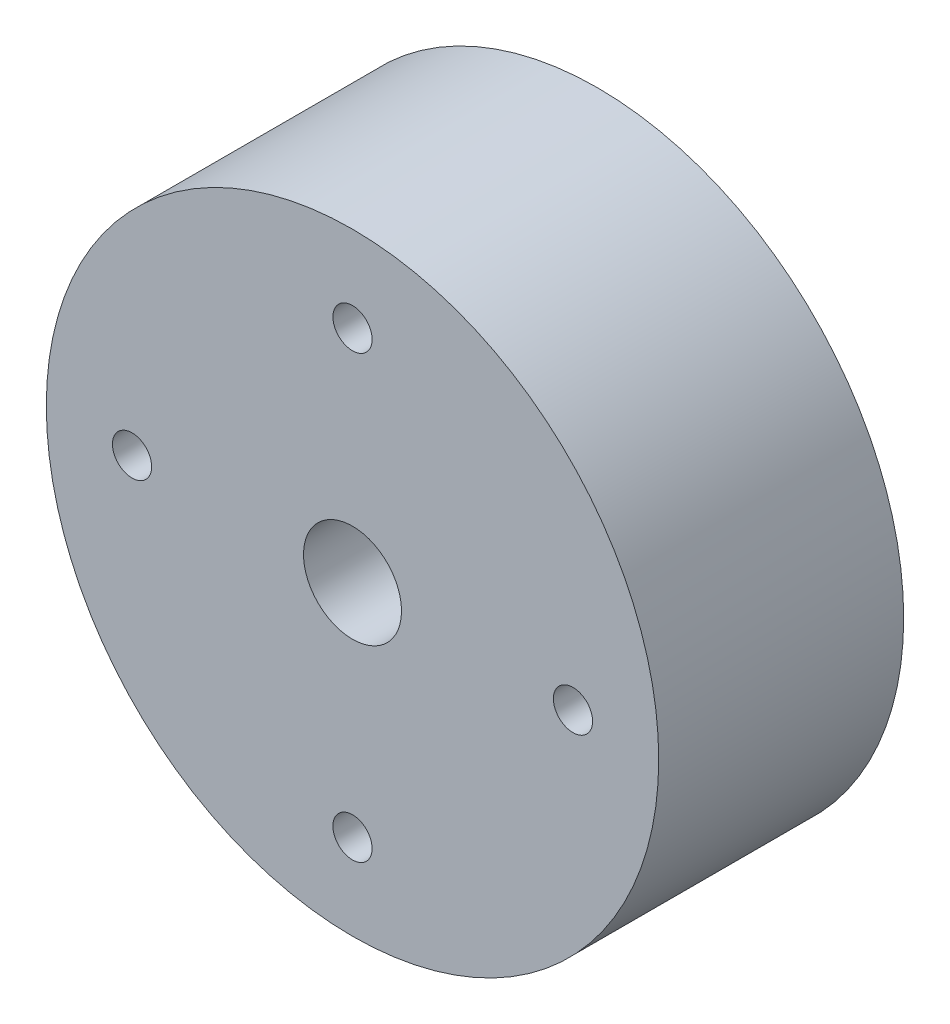
ISO-10303-21;
HEADER;
FILE_DESCRIPTION(('STEP AP214'),'2;1');
FILE_NAME('part.step','',(''),(''),'','','');
FILE_SCHEMA(('AUTOMOTIVE_DESIGN { 1 0 10303 214 1 1 1 1 }'));
ENDSEC;
DATA;
#1=APPLICATION_CONTEXT('core data for automotive mechanical design processes');
#2=APPLICATION_PROTOCOL_DEFINITION('international standard','automotive_design',2000,#1);
#3=PRODUCT_CONTEXT('',#1,'mechanical');
#4=PRODUCT('Part','Part','',(#3));
#5=PRODUCT_RELATED_PRODUCT_CATEGORY('part','',(#4));
#6=PRODUCT_DEFINITION_FORMATION('','',#4);
#7=PRODUCT_DEFINITION_CONTEXT('part definition',#1,'design');
#8=PRODUCT_DEFINITION('design','',#6,#7);
#9=PRODUCT_DEFINITION_SHAPE('','',#8);
#10=(LENGTH_UNIT() NAMED_UNIT(*) SI_UNIT(.MILLI.,.METRE.));
#11=(NAMED_UNIT(*) PLANE_ANGLE_UNIT() SI_UNIT($,.RADIAN.));
#12=(NAMED_UNIT(*) SI_UNIT($,.STERADIAN.) SOLID_ANGLE_UNIT());
#13=UNCERTAINTY_MEASURE_WITH_UNIT(LENGTH_MEASURE(1.E-05),#10,'distance_accuracy_value','');
#14=(GEOMETRIC_REPRESENTATION_CONTEXT(3) GLOBAL_UNCERTAINTY_ASSIGNED_CONTEXT((#13)) GLOBAL_UNIT_ASSIGNED_CONTEXT((#10,
#11,#12)) REPRESENTATION_CONTEXT('',''));
#15=CARTESIAN_POINT('',(0.,0.,0.));
#16=DIRECTION('',(0.,0.,1.));
#17=DIRECTION('',(1.,0.,0.));
#18=AXIS2_PLACEMENT_3D('',#15,#16,#17);
#19=CARTESIAN_POINT('',(0.,0.,20.));
#20=DIRECTION('',(0.,0.,1.));
#21=DIRECTION('',(1.,0.,0.));
#22=AXIS2_PLACEMENT_3D('',#19,#20,#21);
#23=PLANE('',#22);
#24=CARTESIAN_POINT('',(0.,18.,20.));
#25=DIRECTION('',(0.,0.,1.));
#26=DIRECTION('',(1.,0.,0.));
#27=AXIS2_PLACEMENT_3D('',#24,#25,#26);
#28=CIRCLE('',#27,1.6);
#29=CARTESIAN_POINT('',(1.6,18.,20.));
#30=VERTEX_POINT('',#29);
#31=EDGE_CURVE('E80',#30,#30,#28,.T.);
#32=ORIENTED_EDGE('',*,*,#31,.F.);
#33=EDGE_LOOP('',(#32));
#34=FACE_BOUND('',#33,.T.);
#35=CARTESIAN_POINT('',(18.0000000000005,5.08284223389574E-13,20.));
#36=DIRECTION('',(0.,0.,1.));
#37=DIRECTION('',(1.,0.,0.));
#38=AXIS2_PLACEMENT_3D('',#35,#36,#37);
#39=CIRCLE('',#38,1.6000000000004);
#40=CARTESIAN_POINT('',(19.6000000000009,5.08284223389574E-13,20.));
#41=VERTEX_POINT('',#40);
#42=EDGE_CURVE('E74',#41,#41,#39,.T.);
#43=ORIENTED_EDGE('',*,*,#42,.F.);
#44=EDGE_LOOP('',(#43));
#45=FACE_BOUND('',#44,.T.);
#46=CARTESIAN_POINT('',(1.01656844677915E-12,-18.,20.));
#47=DIRECTION('',(0.,0.,1.));
#48=DIRECTION('',(1.,0.,0.));
#49=AXIS2_PLACEMENT_3D('',#46,#47,#48);
#50=CIRCLE('',#49,1.60000000000109);
#51=CARTESIAN_POINT('',(1.60000000000211,-18.,20.));
#52=VERTEX_POINT('',#51);
#53=EDGE_CURVE('E68',#52,#52,#50,.T.);
#54=ORIENTED_EDGE('',*,*,#53,.F.);
#55=EDGE_LOOP('',(#54));
#56=FACE_BOUND('',#55,.T.);
#57=CARTESIAN_POINT('',(-17.9999999999995,-5.10488587628039E-13,20.));
#58=DIRECTION('',(0.,0.,1.));
#59=DIRECTION('',(1.,0.,0.));
#60=AXIS2_PLACEMENT_3D('',#57,#58,#59);
#61=CIRCLE('',#60,1.60000000000082);
#62=CARTESIAN_POINT('',(-16.3999999999987,-5.10488587628039E-13,20.));
#63=VERTEX_POINT('',#62);
#64=EDGE_CURVE('E62',#63,#63,#61,.T.);
#65=ORIENTED_EDGE('',*,*,#64,.F.);
#66=EDGE_LOOP('',(#65));
#67=FACE_BOUND('',#66,.T.);
#68=CARTESIAN_POINT('',(0.,0.,20.));
#69=DIRECTION('',(0.,0.,1.));
#70=DIRECTION('',(1.,0.,0.));
#71=AXIS2_PLACEMENT_3D('',#68,#69,#70);
#72=CIRCLE('',#71,25.);
#73=CARTESIAN_POINT('',(25.,0.,20.));
#74=VERTEX_POINT('',#73);
#75=EDGE_CURVE('E11',#74,#74,#72,.T.);
#76=ORIENTED_EDGE('',*,*,#75,.T.);
#77=EDGE_LOOP('',(#76));
#78=FACE_BOUND('',#77,.T.);
#79=CARTESIAN_POINT('',(0.,0.,20.));
#80=DIRECTION('',(0.,0.,1.));
#81=DIRECTION('',(1.,0.,0.));
#82=AXIS2_PLACEMENT_3D('',#79,#80,#81);
#83=CIRCLE('',#82,4.);
#84=CARTESIAN_POINT('',(4.,0.,20.));
#85=VERTEX_POINT('',#84);
#86=EDGE_CURVE('E54',#85,#85,#83,.T.);
#87=ORIENTED_EDGE('',*,*,#86,.F.);
#88=EDGE_LOOP('',(#87));
#89=FACE_BOUND('',#88,.T.);
#90=ADVANCED_FACE('F43',(#34,#45,#56,#67,#78,#89),#23,.T.);
#91=CARTESIAN_POINT('',(0.,0.,0.));
#92=DIRECTION('',(0.,0.,1.));
#93=DIRECTION('',(1.,0.,0.));
#94=AXIS2_PLACEMENT_3D('',#91,#92,#93);
#95=PLANE('',#94);
#96=CARTESIAN_POINT('',(0.,0.,0.));
#97=DIRECTION('',(0.,0.,1.));
#98=DIRECTION('',(1.,0.,0.));
#99=AXIS2_PLACEMENT_3D('',#96,#97,#98);
#100=CIRCLE('',#99,25.);
#101=CARTESIAN_POINT('',(25.,0.,0.));
#102=VERTEX_POINT('',#101);
#103=EDGE_CURVE('E47',#102,#102,#100,.T.);
#104=ORIENTED_EDGE('',*,*,#103,.F.);
#105=EDGE_LOOP('',(#104));
#106=FACE_BOUND('',#105,.T.);
#107=CARTESIAN_POINT('',(0.,0.,0.));
#108=DIRECTION('',(0.,0.,1.));
#109=DIRECTION('',(1.,0.,0.));
#110=AXIS2_PLACEMENT_3D('',#107,#108,#109);
#111=CIRCLE('',#110,4.);
#112=CARTESIAN_POINT('',(4.,0.,0.));
#113=VERTEX_POINT('',#112);
#114=EDGE_CURVE('E56',#113,#113,#111,.T.);
#115=ORIENTED_EDGE('',*,*,#114,.T.);
#116=EDGE_LOOP('',(#115));
#117=FACE_BOUND('',#116,.T.);
#118=ADVANCED_FACE('F97',(#106,#117),#95,.F.);
#119=CARTESIAN_POINT('',(0.,0.,20.));
#120=DIRECTION('',(0.,0.,-1.));
#121=DIRECTION('',(-1.,0.,0.));
#122=AXIS2_PLACEMENT_3D('',#119,#120,#121);
#123=CYLINDRICAL_SURFACE('',#122,25.);
#124=ORIENTED_EDGE('',*,*,#75,.F.);
#125=EDGE_LOOP('',(#124));
#126=FACE_BOUND('',#125,.T.);
#127=ORIENTED_EDGE('',*,*,#103,.T.);
#128=EDGE_LOOP('',(#127));
#129=FACE_BOUND('',#128,.T.);
#130=ADVANCED_FACE('F45',(#126,#129),#123,.T.);
#131=CARTESIAN_POINT('',(0.,0.,20.));
#132=DIRECTION('',(0.,0.,-1.));
#133=DIRECTION('',(-1.,0.,0.));
#134=AXIS2_PLACEMENT_3D('',#131,#132,#133);
#135=CYLINDRICAL_SURFACE('',#134,4.);
#136=ORIENTED_EDGE('',*,*,#86,.T.);
#137=EDGE_LOOP('',(#136));
#138=FACE_BOUND('',#137,.T.);
#139=ORIENTED_EDGE('',*,*,#114,.F.);
#140=EDGE_LOOP('',(#139));
#141=FACE_BOUND('',#140,.T.);
#142=ADVANCED_FACE('F107',(#138,#141),#135,.F.);
#143=CARTESIAN_POINT('',(-17.9999999999995,-5.10488587628039E-13,10.));
#144=DIRECTION('',(0.,0.,1.));
#145=DIRECTION('',(1.,0.,0.));
#146=AXIS2_PLACEMENT_3D('',#143,#144,#145);
#147=CYLINDRICAL_SURFACE('',#146,1.60000000000082);
#148=CARTESIAN_POINT('',(-17.9999999999995,-5.10488587628039E-13,10.));
#149=DIRECTION('',(0.,0.,1.));
#150=DIRECTION('',(1.,0.,0.));
#151=AXIS2_PLACEMENT_3D('',#148,#149,#150);
#152=CIRCLE('',#151,1.60000000000082);
#153=CARTESIAN_POINT('',(-16.3999999999987,-5.10488587628039E-13,10.));
#154=VERTEX_POINT('',#153);
#155=EDGE_CURVE('E65',#154,#154,#152,.T.);
#156=ORIENTED_EDGE('',*,*,#155,.F.);
#157=EDGE_LOOP('',(#156));
#158=FACE_BOUND('',#157,.T.);
#159=ORIENTED_EDGE('',*,*,#64,.T.);
#160=EDGE_LOOP('',(#159));
#161=FACE_BOUND('',#160,.T.);
#162=ADVANCED_FACE('F110',(#158,#161),#147,.F.);
#163=CARTESIAN_POINT('',(-17.9999999999995,-5.10488587628039E-13,10.));
#164=DIRECTION('',(0.,0.,1.));
#165=DIRECTION('',(1.,0.,0.));
#166=AXIS2_PLACEMENT_3D('',#163,#164,#165);
#167=PLANE('',#166);
#168=ORIENTED_EDGE('',*,*,#155,.T.);
#169=EDGE_LOOP('',(#168));
#170=FACE_BOUND('',#169,.T.);
#171=ADVANCED_FACE('F124',(#170),#167,.T.);
#172=CARTESIAN_POINT('',(1.01656844677915E-12,-18.,10.));
#173=DIRECTION('',(0.,0.,1.));
#174=DIRECTION('',(1.,0.,0.));
#175=AXIS2_PLACEMENT_3D('',#172,#173,#174);
#176=CYLINDRICAL_SURFACE('',#175,1.60000000000109);
#177=CARTESIAN_POINT('',(1.01656844677915E-12,-18.,10.));
#178=DIRECTION('',(0.,0.,1.));
#179=DIRECTION('',(1.,0.,0.));
#180=AXIS2_PLACEMENT_3D('',#177,#178,#179);
#181=CIRCLE('',#180,1.60000000000109);
#182=CARTESIAN_POINT('',(1.60000000000211,-18.,10.));
#183=VERTEX_POINT('',#182);
#184=EDGE_CURVE('E71',#183,#183,#181,.T.);
#185=ORIENTED_EDGE('',*,*,#184,.F.);
#186=EDGE_LOOP('',(#185));
#187=FACE_BOUND('',#186,.T.);
#188=ORIENTED_EDGE('',*,*,#53,.T.);
#189=EDGE_LOOP('',(#188));
#190=FACE_BOUND('',#189,.T.);
#191=ADVANCED_FACE('F128',(#187,#190),#176,.F.);
#192=CARTESIAN_POINT('',(1.01656844677915E-12,-18.,10.));
#193=DIRECTION('',(0.,0.,1.));
#194=DIRECTION('',(1.,0.,0.));
#195=AXIS2_PLACEMENT_3D('',#192,#193,#194);
#196=PLANE('',#195);
#197=ORIENTED_EDGE('',*,*,#184,.T.);
#198=EDGE_LOOP('',(#197));
#199=FACE_BOUND('',#198,.T.);
#200=ADVANCED_FACE('F132',(#199),#196,.T.);
#201=CARTESIAN_POINT('',(18.0000000000005,5.08284223389574E-13,10.));
#202=DIRECTION('',(0.,0.,1.));
#203=DIRECTION('',(1.,0.,0.));
#204=AXIS2_PLACEMENT_3D('',#201,#202,#203);
#205=CYLINDRICAL_SURFACE('',#204,1.6000000000004);
#206=CARTESIAN_POINT('',(18.0000000000005,5.08284223389574E-13,10.));
#207=DIRECTION('',(0.,0.,1.));
#208=DIRECTION('',(1.,0.,0.));
#209=AXIS2_PLACEMENT_3D('',#206,#207,#208);
#210=CIRCLE('',#209,1.6000000000004);
#211=CARTESIAN_POINT('',(19.6000000000009,5.08284223389574E-13,10.));
#212=VERTEX_POINT('',#211);
#213=EDGE_CURVE('E77',#212,#212,#210,.T.);
#214=ORIENTED_EDGE('',*,*,#213,.F.);
#215=EDGE_LOOP('',(#214));
#216=FACE_BOUND('',#215,.T.);
#217=ORIENTED_EDGE('',*,*,#42,.T.);
#218=EDGE_LOOP('',(#217));
#219=FACE_BOUND('',#218,.T.);
#220=ADVANCED_FACE('F136',(#216,#219),#205,.F.);
#221=CARTESIAN_POINT('',(18.0000000000005,5.08284223389574E-13,10.));
#222=DIRECTION('',(0.,0.,1.));
#223=DIRECTION('',(1.,0.,0.));
#224=AXIS2_PLACEMENT_3D('',#221,#222,#223);
#225=PLANE('',#224);
#226=ORIENTED_EDGE('',*,*,#213,.T.);
#227=EDGE_LOOP('',(#226));
#228=FACE_BOUND('',#227,.T.);
#229=ADVANCED_FACE('F91',(#228),#225,.T.);
#230=CARTESIAN_POINT('',(0.,18.,10.));
#231=DIRECTION('',(0.,0.,1.));
#232=DIRECTION('',(1.,0.,0.));
#233=AXIS2_PLACEMENT_3D('',#230,#231,#232);
#234=CYLINDRICAL_SURFACE('',#233,1.6);
#235=CARTESIAN_POINT('',(0.,18.,10.));
#236=DIRECTION('',(0.,0.,1.));
#237=DIRECTION('',(1.,0.,0.));
#238=AXIS2_PLACEMENT_3D('',#235,#236,#237);
#239=CIRCLE('',#238,1.6);
#240=CARTESIAN_POINT('',(1.6,18.,10.));
#241=VERTEX_POINT('',#240);
#242=EDGE_CURVE('E59',#241,#241,#239,.T.);
#243=ORIENTED_EDGE('',*,*,#242,.F.);
#244=EDGE_LOOP('',(#243));
#245=FACE_BOUND('',#244,.T.);
#246=ORIENTED_EDGE('',*,*,#31,.T.);
#247=EDGE_LOOP('',(#246));
#248=FACE_BOUND('',#247,.T.);
#249=ADVANCED_FACE('F88',(#245,#248),#234,.F.);
#250=CARTESIAN_POINT('',(0.,18.,10.));
#251=DIRECTION('',(0.,0.,1.));
#252=DIRECTION('',(1.,0.,0.));
#253=AXIS2_PLACEMENT_3D('',#250,#251,#252);
#254=PLANE('',#253);
#255=ORIENTED_EDGE('',*,*,#242,.T.);
#256=EDGE_LOOP('',(#255));
#257=FACE_BOUND('',#256,.T.);
#258=ADVANCED_FACE('F86',(#257),#254,.T.);
#259=CLOSED_SHELL('',(#90,#118,#130,#142,#162,#171,#191,#200,#220,#229,#249,#258));
#260=MANIFOLD_SOLID_BREP('B2',#259);
#261=ADVANCED_BREP_SHAPE_REPRESENTATION('',(#18,#260),#14);
#262=SHAPE_DEFINITION_REPRESENTATION(#9,#261);
ENDSEC;
END-ISO-10303-21;
